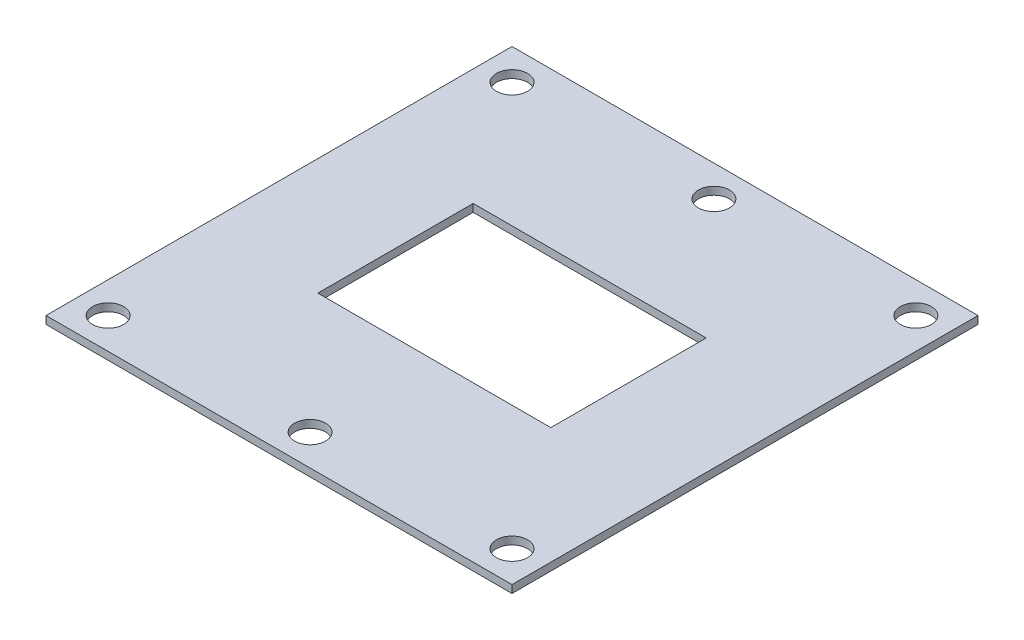
ISO-10303-21;
HEADER;
FILE_DESCRIPTION(('STEP AP214'),'2;1');
FILE_NAME('part.step','',(''),(''),'','','');
FILE_SCHEMA(('AUTOMOTIVE_DESIGN { 1 0 10303 214 1 1 1 1 }'));
ENDSEC;
DATA;
#1=APPLICATION_CONTEXT('core data for automotive mechanical design processes');
#2=APPLICATION_PROTOCOL_DEFINITION('international standard','automotive_design',2000,#1);
#3=PRODUCT_CONTEXT('',#1,'mechanical');
#4=PRODUCT('Part','Part','',(#3));
#5=PRODUCT_RELATED_PRODUCT_CATEGORY('part','',(#4));
#6=PRODUCT_DEFINITION_FORMATION('','',#4);
#7=PRODUCT_DEFINITION_CONTEXT('part definition',#1,'design');
#8=PRODUCT_DEFINITION('design','',#6,#7);
#9=PRODUCT_DEFINITION_SHAPE('','',#8);
#10=(LENGTH_UNIT() NAMED_UNIT(*) SI_UNIT(.MILLI.,.METRE.));
#11=(NAMED_UNIT(*) PLANE_ANGLE_UNIT() SI_UNIT($,.RADIAN.));
#12=(NAMED_UNIT(*) SI_UNIT($,.STERADIAN.) SOLID_ANGLE_UNIT());
#13=UNCERTAINTY_MEASURE_WITH_UNIT(LENGTH_MEASURE(1.E-05),#10,'distance_accuracy_value','');
#14=(GEOMETRIC_REPRESENTATION_CONTEXT(3) GLOBAL_UNCERTAINTY_ASSIGNED_CONTEXT((#13)) GLOBAL_UNIT_ASSIGNED_CONTEXT((#10,
#11,#12)) REPRESENTATION_CONTEXT('',''));
#15=CARTESIAN_POINT('',(0.,0.,0.));
#16=DIRECTION('',(0.,0.,1.));
#17=DIRECTION('',(1.,0.,0.));
#18=AXIS2_PLACEMENT_3D('',#15,#16,#17);
#19=CARTESIAN_POINT('',(-30.,1.,30.));
#20=DIRECTION('',(1.,0.,0.));
#21=DIRECTION('',(0.,0.,-1.));
#22=AXIS2_PLACEMENT_3D('',#19,#20,#21);
#23=PLANE('',#22);
#24=DIRECTION('',(0.,0.,1.));
#25=VECTOR('',#24,1.);
#26=CARTESIAN_POINT('',(-30.,0.,30.));
#27=LINE('',#26,#25);
#28=CARTESIAN_POINT('',(-30.,0.,-30.));
#29=VERTEX_POINT('',#28);
#30=CARTESIAN_POINT('',(-30.,0.,30.));
#31=VERTEX_POINT('',#30);
#32=EDGE_CURVE('E163',#29,#31,#27,.T.);
#33=ORIENTED_EDGE('',*,*,#32,.T.);
#34=DIRECTION('',(0.,-1.,0.));
#35=VECTOR('',#34,1.);
#36=CARTESIAN_POINT('',(-30.,1.,30.));
#37=LINE('',#36,#35);
#38=CARTESIAN_POINT('',(-30.,1.,30.));
#39=VERTEX_POINT('',#38);
#40=EDGE_CURVE('E190',#39,#31,#37,.T.);
#41=ORIENTED_EDGE('',*,*,#40,.F.);
#42=DIRECTION('',(0.,0.,1.));
#43=VECTOR('',#42,1.);
#44=CARTESIAN_POINT('',(-30.,1.,30.));
#45=LINE('',#44,#43);
#46=CARTESIAN_POINT('',(-30.,1.,-30.));
#47=VERTEX_POINT('',#46);
#48=EDGE_CURVE('E164',#47,#39,#45,.T.);
#49=ORIENTED_EDGE('',*,*,#48,.F.);
#50=DIRECTION('',(0.,-1.,0.));
#51=VECTOR('',#50,1.);
#52=CARTESIAN_POINT('',(-30.,1.,-30.));
#53=LINE('',#52,#51);
#54=EDGE_CURVE('E174',#47,#29,#53,.T.);
#55=ORIENTED_EDGE('',*,*,#54,.T.);
#56=EDGE_LOOP('',(#33,#41,#49,#55));
#57=FACE_BOUND('',#56,.T.);
#58=ADVANCED_FACE('F35',(#57),#23,.F.);
#59=CARTESIAN_POINT('',(30.,1.,30.));
#60=DIRECTION('',(0.,0.,-1.));
#61=DIRECTION('',(-1.,0.,0.));
#62=AXIS2_PLACEMENT_3D('',#59,#60,#61);
#63=PLANE('',#62);
#64=DIRECTION('',(1.,0.,0.));
#65=VECTOR('',#64,1.);
#66=CARTESIAN_POINT('',(30.,0.,30.));
#67=LINE('',#66,#65);
#68=CARTESIAN_POINT('',(30.,0.,30.));
#69=VERTEX_POINT('',#68);
#70=EDGE_CURVE('E177',#31,#69,#67,.T.);
#71=ORIENTED_EDGE('',*,*,#70,.T.);
#72=DIRECTION('',(0.,-1.,0.));
#73=VECTOR('',#72,1.);
#74=CARTESIAN_POINT('',(30.,1.,30.));
#75=LINE('',#74,#73);
#76=CARTESIAN_POINT('',(30.,1.,30.));
#77=VERTEX_POINT('',#76);
#78=EDGE_CURVE('E187',#77,#69,#75,.T.);
#79=ORIENTED_EDGE('',*,*,#78,.F.);
#80=DIRECTION('',(1.,0.,0.));
#81=VECTOR('',#80,1.);
#82=CARTESIAN_POINT('',(30.,1.,30.));
#83=LINE('',#82,#81);
#84=EDGE_CURVE('E167',#39,#77,#83,.T.);
#85=ORIENTED_EDGE('',*,*,#84,.F.);
#86=ORIENTED_EDGE('',*,*,#40,.T.);
#87=EDGE_LOOP('',(#71,#79,#85,#86));
#88=FACE_BOUND('',#87,.T.);
#89=ADVANCED_FACE('F216',(#88),#63,.F.);
#90=CARTESIAN_POINT('',(30.,1.,30.));
#91=DIRECTION('',(-1.,0.,0.));
#92=DIRECTION('',(0.,0.,1.));
#93=AXIS2_PLACEMENT_3D('',#90,#91,#92);
#94=PLANE('',#93);
#95=DIRECTION('',(0.,0.,-1.));
#96=VECTOR('',#95,1.);
#97=CARTESIAN_POINT('',(30.,0.,30.));
#98=LINE('',#97,#96);
#99=CARTESIAN_POINT('',(30.,0.,-30.));
#100=VERTEX_POINT('',#99);
#101=EDGE_CURVE('E179',#69,#100,#98,.T.);
#102=ORIENTED_EDGE('',*,*,#101,.T.);
#103=DIRECTION('',(0.,-1.,0.));
#104=VECTOR('',#103,1.);
#105=CARTESIAN_POINT('',(30.,1.,-30.));
#106=LINE('',#105,#104);
#107=CARTESIAN_POINT('',(30.,1.,-30.));
#108=VERTEX_POINT('',#107);
#109=EDGE_CURVE('E184',#108,#100,#106,.T.);
#110=ORIENTED_EDGE('',*,*,#109,.F.);
#111=DIRECTION('',(0.,0.,-1.));
#112=VECTOR('',#111,1.);
#113=CARTESIAN_POINT('',(30.,1.,30.));
#114=LINE('',#113,#112);
#115=EDGE_CURVE('E170',#77,#108,#114,.T.);
#116=ORIENTED_EDGE('',*,*,#115,.F.);
#117=ORIENTED_EDGE('',*,*,#78,.T.);
#118=EDGE_LOOP('',(#102,#110,#116,#117));
#119=FACE_BOUND('',#118,.T.);
#120=ADVANCED_FACE('F221',(#119),#94,.F.);
#121=CARTESIAN_POINT('',(30.,1.,-30.));
#122=DIRECTION('',(0.,0.,1.));
#123=DIRECTION('',(1.,0.,0.));
#124=AXIS2_PLACEMENT_3D('',#121,#122,#123);
#125=PLANE('',#124);
#126=DIRECTION('',(-1.,0.,0.));
#127=VECTOR('',#126,1.);
#128=CARTESIAN_POINT('',(30.,0.,-30.));
#129=LINE('',#128,#127);
#130=EDGE_CURVE('E168',#100,#29,#129,.T.);
#131=ORIENTED_EDGE('',*,*,#130,.T.);
#132=ORIENTED_EDGE('',*,*,#54,.F.);
#133=DIRECTION('',(-1.,0.,0.));
#134=VECTOR('',#133,1.);
#135=CARTESIAN_POINT('',(30.,1.,-30.));
#136=LINE('',#135,#134);
#137=EDGE_CURVE('E172',#108,#47,#136,.T.);
#138=ORIENTED_EDGE('',*,*,#137,.F.);
#139=ORIENTED_EDGE('',*,*,#109,.T.);
#140=EDGE_LOOP('',(#131,#132,#138,#139));
#141=FACE_BOUND('',#140,.T.);
#142=ADVANCED_FACE('F236',(#141),#125,.F.);
#143=CARTESIAN_POINT('',(0.,1.,0.));
#144=DIRECTION('',(0.,1.,0.));
#145=DIRECTION('',(0.,0.,1.));
#146=AXIS2_PLACEMENT_3D('',#143,#144,#145);
#147=PLANE('',#146);
#148=DIRECTION('',(0.,0.,1.));
#149=VECTOR('',#148,1.);
#150=CARTESIAN_POINT('',(-15.,1.,10.));
#151=LINE('',#150,#149);
#152=CARTESIAN_POINT('',(-15.,1.,-10.));
#153=VERTEX_POINT('',#152);
#154=CARTESIAN_POINT('',(-15.,1.,10.));
#155=VERTEX_POINT('',#154);
#156=EDGE_CURVE('E49',#153,#155,#151,.T.);
#157=ORIENTED_EDGE('',*,*,#156,.F.);
#158=DIRECTION('',(-1.,0.,0.));
#159=VECTOR('',#158,1.);
#160=CARTESIAN_POINT('',(15.,1.,-10.));
#161=LINE('',#160,#159);
#162=CARTESIAN_POINT('',(15.,1.,-10.));
#163=VERTEX_POINT('',#162);
#164=EDGE_CURVE('E118',#163,#153,#161,.T.);
#165=ORIENTED_EDGE('',*,*,#164,.F.);
#166=DIRECTION('',(0.,0.,-1.));
#167=VECTOR('',#166,1.);
#168=CARTESIAN_POINT('',(15.,1.,10.));
#169=LINE('',#168,#167);
#170=CARTESIAN_POINT('',(15.,1.,10.));
#171=VERTEX_POINT('',#170);
#172=EDGE_CURVE('E102',#171,#163,#169,.T.);
#173=ORIENTED_EDGE('',*,*,#172,.F.);
#174=DIRECTION('',(1.,0.,0.));
#175=VECTOR('',#174,1.);
#176=CARTESIAN_POINT('',(15.,1.,10.));
#177=LINE('',#176,#175);
#178=EDGE_CURVE('E111',#155,#171,#177,.T.);
#179=ORIENTED_EDGE('',*,*,#178,.F.);
#180=EDGE_LOOP('',(#157,#165,#173,#179));
#181=FACE_BOUND('',#180,.T.);
#182=CARTESIAN_POINT('',(26.,1.,-26.));
#183=DIRECTION('',(0.,1.,0.));
#184=DIRECTION('',(0.,0.,1.));
#185=AXIS2_PLACEMENT_3D('',#182,#183,#184);
#186=CIRCLE('',#185,2.);
#187=CARTESIAN_POINT('',(26.,1.,-24.));
#188=VERTEX_POINT('',#187);
#189=EDGE_CURVE('E125',#188,#188,#186,.T.);
#190=ORIENTED_EDGE('',*,*,#189,.F.);
#191=EDGE_LOOP('',(#190));
#192=FACE_BOUND('',#191,.T.);
#193=CARTESIAN_POINT('',(0.,1.,-26.));
#194=DIRECTION('',(0.,1.,0.));
#195=DIRECTION('',(0.,0.,1.));
#196=AXIS2_PLACEMENT_3D('',#193,#194,#195);
#197=CIRCLE('',#196,2.);
#198=CARTESIAN_POINT('',(0.,1.,-24.));
#199=VERTEX_POINT('',#198);
#200=EDGE_CURVE('E133',#199,#199,#197,.T.);
#201=ORIENTED_EDGE('',*,*,#200,.F.);
#202=EDGE_LOOP('',(#201));
#203=FACE_BOUND('',#202,.T.);
#204=CARTESIAN_POINT('',(-26.,1.,-26.));
#205=DIRECTION('',(0.,1.,0.));
#206=DIRECTION('',(0.,0.,1.));
#207=AXIS2_PLACEMENT_3D('',#204,#205,#206);
#208=CIRCLE('',#207,2.);
#209=CARTESIAN_POINT('',(-26.,1.,-24.));
#210=VERTEX_POINT('',#209);
#211=EDGE_CURVE('E139',#210,#210,#208,.T.);
#212=ORIENTED_EDGE('',*,*,#211,.F.);
#213=EDGE_LOOP('',(#212));
#214=FACE_BOUND('',#213,.T.);
#215=CARTESIAN_POINT('',(0.,1.,26.));
#216=DIRECTION('',(0.,1.,0.));
#217=DIRECTION('',(0.,0.,1.));
#218=AXIS2_PLACEMENT_3D('',#215,#216,#217);
#219=CIRCLE('',#218,2.);
#220=CARTESIAN_POINT('',(0.,1.,28.));
#221=VERTEX_POINT('',#220);
#222=EDGE_CURVE('E145',#221,#221,#219,.T.);
#223=ORIENTED_EDGE('',*,*,#222,.F.);
#224=EDGE_LOOP('',(#223));
#225=FACE_BOUND('',#224,.T.);
#226=CARTESIAN_POINT('',(26.,1.,26.));
#227=DIRECTION('',(0.,1.,0.));
#228=DIRECTION('',(0.,0.,1.));
#229=AXIS2_PLACEMENT_3D('',#226,#227,#228);
#230=CIRCLE('',#229,2.);
#231=CARTESIAN_POINT('',(26.,1.,28.));
#232=VERTEX_POINT('',#231);
#233=EDGE_CURVE('E151',#232,#232,#230,.T.);
#234=ORIENTED_EDGE('',*,*,#233,.F.);
#235=EDGE_LOOP('',(#234));
#236=FACE_BOUND('',#235,.T.);
#237=CARTESIAN_POINT('',(-26.,1.,26.));
#238=DIRECTION('',(0.,1.,0.));
#239=DIRECTION('',(0.,0.,1.));
#240=AXIS2_PLACEMENT_3D('',#237,#238,#239);
#241=CIRCLE('',#240,2.);
#242=CARTESIAN_POINT('',(-26.,1.,28.));
#243=VERTEX_POINT('',#242);
#244=EDGE_CURVE('E157',#243,#243,#241,.T.);
#245=ORIENTED_EDGE('',*,*,#244,.F.);
#246=EDGE_LOOP('',(#245));
#247=FACE_BOUND('',#246,.T.);
#248=ORIENTED_EDGE('',*,*,#48,.T.);
#249=ORIENTED_EDGE('',*,*,#84,.T.);
#250=ORIENTED_EDGE('',*,*,#115,.T.);
#251=ORIENTED_EDGE('',*,*,#137,.T.);
#252=EDGE_LOOP('',(#248,#249,#250,#251));
#253=FACE_BOUND('',#252,.T.);
#254=ADVANCED_FACE('F115',(#181,#192,#203,#214,#225,#236,#247,#253),#147,.T.);
#255=CARTESIAN_POINT('',(0.,0.,0.));
#256=DIRECTION('',(0.,1.,0.));
#257=DIRECTION('',(0.,0.,1.));
#258=AXIS2_PLACEMENT_3D('',#255,#256,#257);
#259=PLANE('',#258);
#260=DIRECTION('',(-1.,0.,0.));
#261=VECTOR('',#260,1.);
#262=CARTESIAN_POINT('',(0.,0.,-10.));
#263=LINE('',#262,#261);
#264=CARTESIAN_POINT('',(15.,0.,-10.));
#265=VERTEX_POINT('',#264);
#266=CARTESIAN_POINT('',(-15.,0.,-10.));
#267=VERTEX_POINT('',#266);
#268=EDGE_CURVE('E42',#265,#267,#263,.T.);
#269=ORIENTED_EDGE('',*,*,#268,.T.);
#270=DIRECTION('',(0.,0.,1.));
#271=VECTOR('',#270,1.);
#272=CARTESIAN_POINT('',(-15.,0.,0.));
#273=LINE('',#272,#271);
#274=CARTESIAN_POINT('',(-15.,0.,10.));
#275=VERTEX_POINT('',#274);
#276=EDGE_CURVE('E11',#267,#275,#273,.T.);
#277=ORIENTED_EDGE('',*,*,#276,.T.);
#278=DIRECTION('',(1.,0.,0.));
#279=VECTOR('',#278,1.);
#280=CARTESIAN_POINT('',(0.,0.,10.));
#281=LINE('',#280,#279);
#282=CARTESIAN_POINT('',(15.,0.,10.));
#283=VERTEX_POINT('',#282);
#284=EDGE_CURVE('E193',#275,#283,#281,.T.);
#285=ORIENTED_EDGE('',*,*,#284,.T.);
#286=DIRECTION('',(0.,0.,-1.));
#287=VECTOR('',#286,1.);
#288=CARTESIAN_POINT('',(15.,0.,0.));
#289=LINE('',#288,#287);
#290=EDGE_CURVE('E105',#283,#265,#289,.T.);
#291=ORIENTED_EDGE('',*,*,#290,.T.);
#292=EDGE_LOOP('',(#269,#277,#285,#291));
#293=FACE_BOUND('',#292,.T.);
#294=CARTESIAN_POINT('',(26.,0.,-26.));
#295=DIRECTION('',(0.,1.,0.));
#296=DIRECTION('',(0.,0.,1.));
#297=AXIS2_PLACEMENT_3D('',#294,#295,#296);
#298=CIRCLE('',#297,2.);
#299=CARTESIAN_POINT('',(26.,0.,-24.));
#300=VERTEX_POINT('',#299);
#301=EDGE_CURVE('E130',#300,#300,#298,.T.);
#302=ORIENTED_EDGE('',*,*,#301,.T.);
#303=EDGE_LOOP('',(#302));
#304=FACE_BOUND('',#303,.T.);
#305=CARTESIAN_POINT('',(0.,0.,-26.));
#306=DIRECTION('',(0.,1.,0.));
#307=DIRECTION('',(0.,0.,1.));
#308=AXIS2_PLACEMENT_3D('',#305,#306,#307);
#309=CIRCLE('',#308,2.);
#310=CARTESIAN_POINT('',(0.,0.,-24.));
#311=VERTEX_POINT('',#310);
#312=EDGE_CURVE('E136',#311,#311,#309,.T.);
#313=ORIENTED_EDGE('',*,*,#312,.T.);
#314=EDGE_LOOP('',(#313));
#315=FACE_BOUND('',#314,.T.);
#316=CARTESIAN_POINT('',(-26.,0.,-26.));
#317=DIRECTION('',(0.,1.,0.));
#318=DIRECTION('',(0.,0.,1.));
#319=AXIS2_PLACEMENT_3D('',#316,#317,#318);
#320=CIRCLE('',#319,2.);
#321=CARTESIAN_POINT('',(-26.,0.,-24.));
#322=VERTEX_POINT('',#321);
#323=EDGE_CURVE('E142',#322,#322,#320,.T.);
#324=ORIENTED_EDGE('',*,*,#323,.T.);
#325=EDGE_LOOP('',(#324));
#326=FACE_BOUND('',#325,.T.);
#327=CARTESIAN_POINT('',(0.,0.,26.));
#328=DIRECTION('',(0.,1.,0.));
#329=DIRECTION('',(0.,0.,1.));
#330=AXIS2_PLACEMENT_3D('',#327,#328,#329);
#331=CIRCLE('',#330,2.);
#332=CARTESIAN_POINT('',(0.,0.,28.));
#333=VERTEX_POINT('',#332);
#334=EDGE_CURVE('E148',#333,#333,#331,.T.);
#335=ORIENTED_EDGE('',*,*,#334,.T.);
#336=EDGE_LOOP('',(#335));
#337=FACE_BOUND('',#336,.T.);
#338=CARTESIAN_POINT('',(26.,0.,26.));
#339=DIRECTION('',(0.,1.,0.));
#340=DIRECTION('',(0.,0.,1.));
#341=AXIS2_PLACEMENT_3D('',#338,#339,#340);
#342=CIRCLE('',#341,2.);
#343=CARTESIAN_POINT('',(26.,0.,28.));
#344=VERTEX_POINT('',#343);
#345=EDGE_CURVE('E154',#344,#344,#342,.T.);
#346=ORIENTED_EDGE('',*,*,#345,.T.);
#347=EDGE_LOOP('',(#346));
#348=FACE_BOUND('',#347,.T.);
#349=CARTESIAN_POINT('',(-26.,0.,26.));
#350=DIRECTION('',(0.,1.,0.));
#351=DIRECTION('',(0.,0.,1.));
#352=AXIS2_PLACEMENT_3D('',#349,#350,#351);
#353=CIRCLE('',#352,2.);
#354=CARTESIAN_POINT('',(-26.,0.,28.));
#355=VERTEX_POINT('',#354);
#356=EDGE_CURVE('E160',#355,#355,#353,.T.);
#357=ORIENTED_EDGE('',*,*,#356,.T.);
#358=EDGE_LOOP('',(#357));
#359=FACE_BOUND('',#358,.T.);
#360=ORIENTED_EDGE('',*,*,#32,.F.);
#361=ORIENTED_EDGE('',*,*,#130,.F.);
#362=ORIENTED_EDGE('',*,*,#101,.F.);
#363=ORIENTED_EDGE('',*,*,#70,.F.);
#364=EDGE_LOOP('',(#360,#361,#362,#363));
#365=FACE_BOUND('',#364,.T.);
#366=ADVANCED_FACE('F197',(#293,#304,#315,#326,#337,#348,#359,#365),#259,.F.);
#367=CARTESIAN_POINT('',(-26.,1.,26.));
#368=DIRECTION('',(0.,1.,0.));
#369=DIRECTION('',(0.,0.,1.));
#370=AXIS2_PLACEMENT_3D('',#367,#368,#369);
#371=CYLINDRICAL_SURFACE('',#370,2.);
#372=ORIENTED_EDGE('',*,*,#356,.F.);
#373=EDGE_LOOP('',(#372));
#374=FACE_BOUND('',#373,.T.);
#375=ORIENTED_EDGE('',*,*,#244,.T.);
#376=EDGE_LOOP('',(#375));
#377=FACE_BOUND('',#376,.T.);
#378=ADVANCED_FACE('F247',(#374,#377),#371,.F.);
#379=CARTESIAN_POINT('',(26.,1.,26.));
#380=DIRECTION('',(0.,1.,0.));
#381=DIRECTION('',(0.,0.,1.));
#382=AXIS2_PLACEMENT_3D('',#379,#380,#381);
#383=CYLINDRICAL_SURFACE('',#382,2.);
#384=ORIENTED_EDGE('',*,*,#345,.F.);
#385=EDGE_LOOP('',(#384));
#386=FACE_BOUND('',#385,.T.);
#387=ORIENTED_EDGE('',*,*,#233,.T.);
#388=EDGE_LOOP('',(#387));
#389=FACE_BOUND('',#388,.T.);
#390=ADVANCED_FACE('F252',(#386,#389),#383,.F.);
#391=CARTESIAN_POINT('',(0.,1.,26.));
#392=DIRECTION('',(0.,1.,0.));
#393=DIRECTION('',(0.,0.,1.));
#394=AXIS2_PLACEMENT_3D('',#391,#392,#393);
#395=CYLINDRICAL_SURFACE('',#394,2.);
#396=ORIENTED_EDGE('',*,*,#334,.F.);
#397=EDGE_LOOP('',(#396));
#398=FACE_BOUND('',#397,.T.);
#399=ORIENTED_EDGE('',*,*,#222,.T.);
#400=EDGE_LOOP('',(#399));
#401=FACE_BOUND('',#400,.T.);
#402=ADVANCED_FACE('F256',(#398,#401),#395,.F.);
#403=CARTESIAN_POINT('',(-26.,1.,-26.));
#404=DIRECTION('',(0.,1.,0.));
#405=DIRECTION('',(0.,0.,1.));
#406=AXIS2_PLACEMENT_3D('',#403,#404,#405);
#407=CYLINDRICAL_SURFACE('',#406,2.);
#408=ORIENTED_EDGE('',*,*,#323,.F.);
#409=EDGE_LOOP('',(#408));
#410=FACE_BOUND('',#409,.T.);
#411=ORIENTED_EDGE('',*,*,#211,.T.);
#412=EDGE_LOOP('',(#411));
#413=FACE_BOUND('',#412,.T.);
#414=ADVANCED_FACE('F260',(#410,#413),#407,.F.);
#415=CARTESIAN_POINT('',(0.,1.,-26.));
#416=DIRECTION('',(0.,1.,0.));
#417=DIRECTION('',(0.,0.,1.));
#418=AXIS2_PLACEMENT_3D('',#415,#416,#417);
#419=CYLINDRICAL_SURFACE('',#418,2.);
#420=ORIENTED_EDGE('',*,*,#312,.F.);
#421=EDGE_LOOP('',(#420));
#422=FACE_BOUND('',#421,.T.);
#423=ORIENTED_EDGE('',*,*,#200,.T.);
#424=EDGE_LOOP('',(#423));
#425=FACE_BOUND('',#424,.T.);
#426=ADVANCED_FACE('F211',(#422,#425),#419,.F.);
#427=CARTESIAN_POINT('',(26.,1.,-26.));
#428=DIRECTION('',(0.,1.,0.));
#429=DIRECTION('',(0.,0.,1.));
#430=AXIS2_PLACEMENT_3D('',#427,#428,#429);
#431=CYLINDRICAL_SURFACE('',#430,2.);
#432=ORIENTED_EDGE('',*,*,#301,.F.);
#433=EDGE_LOOP('',(#432));
#434=FACE_BOUND('',#433,.T.);
#435=ORIENTED_EDGE('',*,*,#189,.T.);
#436=EDGE_LOOP('',(#435));
#437=FACE_BOUND('',#436,.T.);
#438=ADVANCED_FACE('F204',(#434,#437),#431,.F.);
#439=CARTESIAN_POINT('',(-15.,-9.,10.));
#440=DIRECTION('',(-1.,0.,0.));
#441=DIRECTION('',(0.,0.,1.));
#442=AXIS2_PLACEMENT_3D('',#439,#440,#441);
#443=PLANE('',#442);
#444=DIRECTION('',(0.,1.,0.));
#445=VECTOR('',#444,1.);
#446=CARTESIAN_POINT('',(-15.,-9.,-10.));
#447=LINE('',#446,#445);
#448=EDGE_CURVE('E123',#267,#153,#447,.T.);
#449=ORIENTED_EDGE('',*,*,#448,.T.);
#450=ORIENTED_EDGE('',*,*,#156,.T.);
#451=DIRECTION('',(0.,1.,0.));
#452=VECTOR('',#451,1.);
#453=CARTESIAN_POINT('',(-15.,-9.,10.));
#454=LINE('',#453,#452);
#455=EDGE_CURVE('E108',#275,#155,#454,.T.);
#456=ORIENTED_EDGE('',*,*,#455,.F.);
#457=ORIENTED_EDGE('',*,*,#276,.F.);
#458=EDGE_LOOP('',(#449,#450,#456,#457));
#459=FACE_BOUND('',#458,.T.);
#460=ADVANCED_FACE('F202',(#459),#443,.F.);
#461=CARTESIAN_POINT('',(15.,-9.,-10.));
#462=DIRECTION('',(0.,0.,-1.));
#463=DIRECTION('',(-1.,0.,0.));
#464=AXIS2_PLACEMENT_3D('',#461,#462,#463);
#465=PLANE('',#464);
#466=DIRECTION('',(0.,1.,0.));
#467=VECTOR('',#466,1.);
#468=CARTESIAN_POINT('',(15.,-9.,-10.));
#469=LINE('',#468,#467);
#470=EDGE_CURVE('E107',#265,#163,#469,.T.);
#471=ORIENTED_EDGE('',*,*,#470,.T.);
#472=ORIENTED_EDGE('',*,*,#164,.T.);
#473=ORIENTED_EDGE('',*,*,#448,.F.);
#474=ORIENTED_EDGE('',*,*,#268,.F.);
#475=EDGE_LOOP('',(#471,#472,#473,#474));
#476=FACE_BOUND('',#475,.T.);
#477=ADVANCED_FACE('F201',(#476),#465,.F.);
#478=CARTESIAN_POINT('',(15.,-9.,10.));
#479=DIRECTION('',(1.,0.,0.));
#480=DIRECTION('',(0.,0.,-1.));
#481=AXIS2_PLACEMENT_3D('',#478,#479,#480);
#482=PLANE('',#481);
#483=DIRECTION('',(0.,1.,0.));
#484=VECTOR('',#483,1.);
#485=CARTESIAN_POINT('',(15.,-9.,10.));
#486=LINE('',#485,#484);
#487=EDGE_CURVE('E57',#283,#171,#486,.T.);
#488=ORIENTED_EDGE('',*,*,#487,.T.);
#489=ORIENTED_EDGE('',*,*,#172,.T.);
#490=ORIENTED_EDGE('',*,*,#470,.F.);
#491=ORIENTED_EDGE('',*,*,#290,.F.);
#492=EDGE_LOOP('',(#488,#489,#490,#491));
#493=FACE_BOUND('',#492,.T.);
#494=ADVANCED_FACE('F99',(#493),#482,.F.);
#495=CARTESIAN_POINT('',(15.,-9.,10.));
#496=DIRECTION('',(0.,0.,1.));
#497=DIRECTION('',(1.,0.,0.));
#498=AXIS2_PLACEMENT_3D('',#495,#496,#497);
#499=PLANE('',#498);
#500=ORIENTED_EDGE('',*,*,#455,.T.);
#501=ORIENTED_EDGE('',*,*,#178,.T.);
#502=ORIENTED_EDGE('',*,*,#487,.F.);
#503=ORIENTED_EDGE('',*,*,#284,.F.);
#504=EDGE_LOOP('',(#500,#501,#502,#503));
#505=FACE_BOUND('',#504,.T.);
#506=ADVANCED_FACE('F112',(#505),#499,.F.);
#507=CLOSED_SHELL('',(#58,#89,#120,#142,#254,#366,#378,#390,#402,#414,#426,#438,#460,#477,#494,#506));
#508=MANIFOLD_SOLID_BREP('B2',#507);
#509=ADVANCED_BREP_SHAPE_REPRESENTATION('',(#18,#508),#14);
#510=SHAPE_DEFINITION_REPRESENTATION(#9,#509);
ENDSEC;
END-ISO-10303-21;
